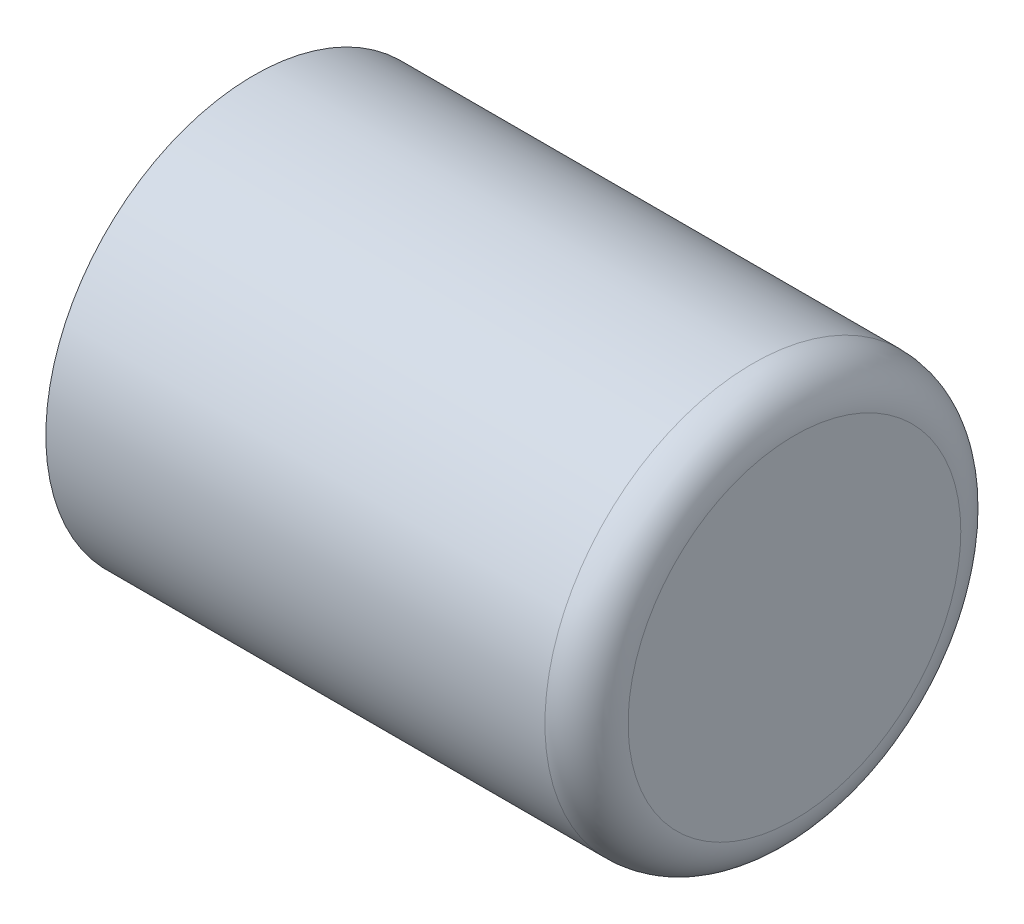
ISO-10303-21;
HEADER;
FILE_DESCRIPTION(('STEP AP214'),'2;1');
FILE_NAME('part.step','',(''),(''),'','','');
FILE_SCHEMA(('AUTOMOTIVE_DESIGN { 1 0 10303 214 1 1 1 1 }'));
ENDSEC;
DATA;
#1=APPLICATION_CONTEXT('core data for automotive mechanical design processes');
#2=APPLICATION_PROTOCOL_DEFINITION('international standard','automotive_design',2000,#1);
#3=PRODUCT_CONTEXT('',#1,'mechanical');
#4=PRODUCT('Part','Part','',(#3));
#5=PRODUCT_RELATED_PRODUCT_CATEGORY('part','',(#4));
#6=PRODUCT_DEFINITION_FORMATION('','',#4);
#7=PRODUCT_DEFINITION_CONTEXT('part definition',#1,'design');
#8=PRODUCT_DEFINITION('design','',#6,#7);
#9=PRODUCT_DEFINITION_SHAPE('','',#8);
#10=(LENGTH_UNIT() NAMED_UNIT(*) SI_UNIT(.MILLI.,.METRE.));
#11=(NAMED_UNIT(*) PLANE_ANGLE_UNIT() SI_UNIT($,.RADIAN.));
#12=(NAMED_UNIT(*) SI_UNIT($,.STERADIAN.) SOLID_ANGLE_UNIT());
#13=UNCERTAINTY_MEASURE_WITH_UNIT(LENGTH_MEASURE(1.E-05),#10,'distance_accuracy_value','');
#14=(GEOMETRIC_REPRESENTATION_CONTEXT(3) GLOBAL_UNCERTAINTY_ASSIGNED_CONTEXT((#13)) GLOBAL_UNIT_ASSIGNED_CONTEXT((#10,
#11,#12)) REPRESENTATION_CONTEXT('',''));
#15=CARTESIAN_POINT('',(0.,0.,0.));
#16=DIRECTION('',(0.,0.,1.));
#17=DIRECTION('',(1.,0.,0.));
#18=AXIS2_PLACEMENT_3D('',#15,#16,#17);
#19=CARTESIAN_POINT('',(0.,0.,0.));
#20=DIRECTION('',(1.,0.,0.));
#21=DIRECTION('',(0.,0.,-1.));
#22=AXIS2_PLACEMENT_3D('',#19,#20,#21);
#23=PLANE('',#22);
#24=CARTESIAN_POINT('',(0.,0.,0.));
#25=DIRECTION('',(1.,0.,0.));
#26=DIRECTION('',(0.,0.,-1.));
#27=AXIS2_PLACEMENT_3D('',#24,#25,#26);
#28=CIRCLE('',#27,5.);
#29=CARTESIAN_POINT('',(0.,0.,-5.));
#30=VERTEX_POINT('',#29);
#31=EDGE_CURVE('E43',#30,#30,#28,.T.);
#32=ORIENTED_EDGE('',*,*,#31,.F.);
#33=EDGE_LOOP('',(#32));
#34=FACE_BOUND('',#33,.T.);
#35=CARTESIAN_POINT('',(0.,0.,0.));
#36=DIRECTION('',(1.,0.,0.));
#37=DIRECTION('',(0.,0.,-1.));
#38=AXIS2_PLACEMENT_3D('',#35,#36,#37);
#39=CIRCLE('',#38,2.5);
#40=CARTESIAN_POINT('',(0.,0.,-2.5));
#41=VERTEX_POINT('',#40);
#42=EDGE_CURVE('E47',#41,#41,#39,.T.);
#43=ORIENTED_EDGE('',*,*,#42,.T.);
#44=EDGE_LOOP('',(#43));
#45=FACE_BOUND('',#44,.T.);
#46=ADVANCED_FACE('F32',(#34,#45),#23,.F.);
#47=CARTESIAN_POINT('',(12.,0.,0.));
#48=DIRECTION('',(-1.,0.,0.));
#49=DIRECTION('',(0.,0.,1.));
#50=AXIS2_PLACEMENT_3D('',#47,#48,#49);
#51=CYLINDRICAL_SURFACE('',#50,5.);
#52=CARTESIAN_POINT('',(12.,0.,0.));
#53=DIRECTION('',(1.,0.,0.));
#54=DIRECTION('',(0.,0.,-1.));
#55=AXIS2_PLACEMENT_3D('',#52,#53,#54);
#56=CIRCLE('',#55,5.);
#57=CARTESIAN_POINT('',(12.,0.,-5.));
#58=VERTEX_POINT('',#57);
#59=EDGE_CURVE('E10',#58,#58,#56,.F.);
#60=ORIENTED_EDGE('',*,*,#59,.T.);
#61=EDGE_LOOP('',(#60));
#62=FACE_BOUND('',#61,.T.);
#63=ORIENTED_EDGE('',*,*,#31,.T.);
#64=EDGE_LOOP('',(#63));
#65=FACE_BOUND('',#64,.T.);
#66=ADVANCED_FACE('F68',(#62,#65),#51,.T.);
#67=CARTESIAN_POINT('',(12.,0.,0.));
#68=DIRECTION('',(-1.,0.,0.));
#69=DIRECTION('',(0.,0.,1.));
#70=AXIS2_PLACEMENT_3D('',#67,#68,#69);
#71=CYLINDRICAL_SURFACE('',#70,2.5);
#72=CARTESIAN_POINT('',(12.,0.,0.));
#73=DIRECTION('',(1.,0.,0.));
#74=DIRECTION('',(0.,0.,-1.));
#75=AXIS2_PLACEMENT_3D('',#72,#73,#74);
#76=CIRCLE('',#75,2.5);
#77=CARTESIAN_POINT('',(12.,0.,-2.5));
#78=VERTEX_POINT('',#77);
#79=EDGE_CURVE('E52',#78,#78,#76,.T.);
#80=ORIENTED_EDGE('',*,*,#79,.T.);
#81=EDGE_LOOP('',(#80));
#82=FACE_BOUND('',#81,.T.);
#83=ORIENTED_EDGE('',*,*,#42,.F.);
#84=EDGE_LOOP('',(#83));
#85=FACE_BOUND('',#84,.T.);
#86=ADVANCED_FACE('F56',(#82,#85),#71,.F.);
#87=CARTESIAN_POINT('',(12.,0.,0.));
#88=DIRECTION('',(1.,0.,0.));
#89=DIRECTION('',(0.,0.,-1.));
#90=AXIS2_PLACEMENT_3D('',#87,#88,#89);
#91=PLANE('',#90);
#92=ORIENTED_EDGE('',*,*,#79,.F.);
#93=EDGE_LOOP('',(#92));
#94=FACE_BOUND('',#93,.T.);
#95=ADVANCED_FACE('F59',(#94),#91,.F.);
#96=CARTESIAN_POINT('',(13.,0.,0.));
#97=DIRECTION('',(1.,0.,0.));
#98=DIRECTION('',(0.,0.,-1.));
#99=AXIS2_PLACEMENT_3D('',#96,#97,#98);
#100=PLANE('',#99);
#101=CARTESIAN_POINT('',(13.,0.,0.));
#102=DIRECTION('',(1.,0.,0.));
#103=DIRECTION('',(0.,0.,-1.));
#104=AXIS2_PLACEMENT_3D('',#101,#102,#103);
#105=CIRCLE('',#104,4.);
#106=CARTESIAN_POINT('',(13.,0.,-4.));
#107=VERTEX_POINT('',#106);
#108=EDGE_CURVE('E39',#107,#107,#105,.T.);
#109=ORIENTED_EDGE('',*,*,#108,.T.);
#110=EDGE_LOOP('',(#109));
#111=FACE_BOUND('',#110,.T.);
#112=ADVANCED_FACE('F61',(#111),#100,.T.);
#113=CARTESIAN_POINT('',(12.,0.,0.));
#114=DIRECTION('',(1.,0.,0.));
#115=DIRECTION('',(0.,0.,-1.));
#116=AXIS2_PLACEMENT_3D('',#113,#114,#115);
#117=TOROIDAL_SURFACE('',#116,4.,1.);
#118=ORIENTED_EDGE('',*,*,#59,.F.);
#119=EDGE_LOOP('',(#118));
#120=FACE_BOUND('',#119,.T.);
#121=ORIENTED_EDGE('',*,*,#108,.F.);
#122=EDGE_LOOP('',(#121));
#123=FACE_BOUND('',#122,.T.);
#124=ADVANCED_FACE('F34',(#120,#123),#117,.T.);
#125=CLOSED_SHELL('',(#46,#66,#86,#95,#112,#124));
#126=MANIFOLD_SOLID_BREP('B2',#125);
#127=ADVANCED_BREP_SHAPE_REPRESENTATION('',(#18,#126),#14);
#128=SHAPE_DEFINITION_REPRESENTATION(#9,#127);
ENDSEC;
END-ISO-10303-21;
